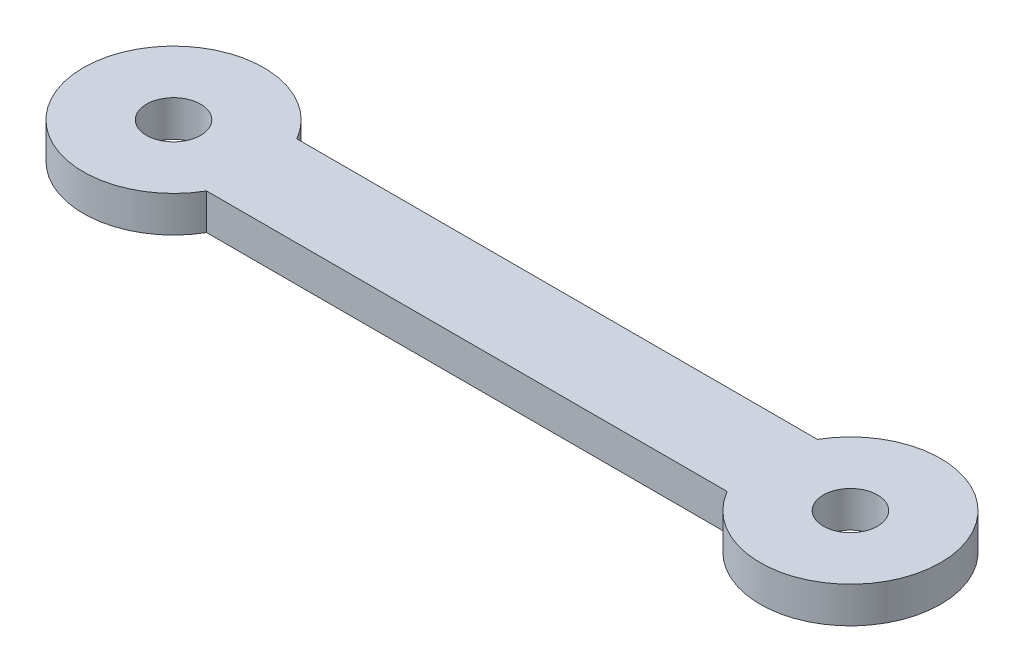
ISO-10303-21;
HEADER;
FILE_DESCRIPTION(('STEP AP214'),'2;1');
FILE_NAME('part.step','',(''),(''),'','','');
FILE_SCHEMA(('AUTOMOTIVE_DESIGN { 1 0 10303 214 1 1 1 1 }'));
ENDSEC;
DATA;
#1=APPLICATION_CONTEXT('core data for automotive mechanical design processes');
#2=APPLICATION_PROTOCOL_DEFINITION('international standard','automotive_design',2000,#1);
#3=PRODUCT_CONTEXT('',#1,'mechanical');
#4=PRODUCT('Part','Part','',(#3));
#5=PRODUCT_RELATED_PRODUCT_CATEGORY('part','',(#4));
#6=PRODUCT_DEFINITION_FORMATION('','',#4);
#7=PRODUCT_DEFINITION_CONTEXT('part definition',#1,'design');
#8=PRODUCT_DEFINITION('design','',#6,#7);
#9=PRODUCT_DEFINITION_SHAPE('','',#8);
#10=(LENGTH_UNIT() NAMED_UNIT(*) SI_UNIT(.MILLI.,.METRE.));
#11=(NAMED_UNIT(*) PLANE_ANGLE_UNIT() SI_UNIT($,.RADIAN.));
#12=(NAMED_UNIT(*) SI_UNIT($,.STERADIAN.) SOLID_ANGLE_UNIT());
#13=UNCERTAINTY_MEASURE_WITH_UNIT(LENGTH_MEASURE(1.E-05),#10,'distance_accuracy_value','');
#14=(GEOMETRIC_REPRESENTATION_CONTEXT(3) GLOBAL_UNCERTAINTY_ASSIGNED_CONTEXT((#13)) GLOBAL_UNIT_ASSIGNED_CONTEXT((#10,
#11,#12)) REPRESENTATION_CONTEXT('',''));
#15=CARTESIAN_POINT('',(0.,0.,0.));
#16=DIRECTION('',(0.,0.,1.));
#17=DIRECTION('',(1.,0.,0.));
#18=AXIS2_PLACEMENT_3D('',#15,#16,#17);
#19=CARTESIAN_POINT('',(75.,2.,0.));
#20=DIRECTION('',(0.,1.,0.));
#21=DIRECTION('',(0.,0.,1.));
#22=AXIS2_PLACEMENT_3D('',#19,#20,#21);
#23=PLANE('',#22);
#24=CARTESIAN_POINT('',(0.,2.,0.));
#25=DIRECTION('',(0.,1.,0.));
#26=DIRECTION('',(0.,0.,1.));
#27=AXIS2_PLACEMENT_3D('',#24,#25,#26);
#28=CIRCLE('',#27,10.);
#29=CARTESIAN_POINT('',(8.66025403784439,2.,5.));
#30=VERTEX_POINT('',#29);
#31=CARTESIAN_POINT('',(8.66025403784439,2.,-5.));
#32=VERTEX_POINT('',#31);
#33=EDGE_CURVE('E88',#30,#32,#28,.F.);
#34=ORIENTED_EDGE('',*,*,#33,.F.);
#35=DIRECTION('',(-1.,0.,0.));
#36=VECTOR('',#35,1.);
#37=CARTESIAN_POINT('',(37.5,2.,5.));
#38=LINE('',#37,#36);
#39=CARTESIAN_POINT('',(66.3397459621556,2.,5.));
#40=VERTEX_POINT('',#39);
#41=EDGE_CURVE('E76',#30,#40,#38,.F.);
#42=ORIENTED_EDGE('',*,*,#41,.T.);
#43=CARTESIAN_POINT('',(75.,2.,0.));
#44=DIRECTION('',(0.,1.,0.));
#45=DIRECTION('',(0.,0.,1.));
#46=AXIS2_PLACEMENT_3D('',#43,#44,#45);
#47=CIRCLE('',#46,10.);
#48=CARTESIAN_POINT('',(66.3397459621556,2.,-5.));
#49=VERTEX_POINT('',#48);
#50=EDGE_CURVE('E35',#49,#40,#47,.F.);
#51=ORIENTED_EDGE('',*,*,#50,.F.);
#52=DIRECTION('',(1.,0.,0.));
#53=VECTOR('',#52,1.);
#54=CARTESIAN_POINT('',(37.5,2.,-5.));
#55=LINE('',#54,#53);
#56=EDGE_CURVE('E75',#49,#32,#55,.F.);
#57=ORIENTED_EDGE('',*,*,#56,.T.);
#58=EDGE_LOOP('',(#34,#42,#51,#57));
#59=FACE_BOUND('',#58,.T.);
#60=CARTESIAN_POINT('',(0.,2.,0.));
#61=DIRECTION('',(0.,1.,0.));
#62=DIRECTION('',(0.,0.,1.));
#63=AXIS2_PLACEMENT_3D('',#60,#61,#62);
#64=CIRCLE('',#63,3.);
#65=CARTESIAN_POINT('',(0.,2.,3.));
#66=VERTEX_POINT('',#65);
#67=EDGE_CURVE('E121',#66,#66,#64,.T.);
#68=ORIENTED_EDGE('',*,*,#67,.F.);
#69=EDGE_LOOP('',(#68));
#70=FACE_BOUND('',#69,.T.);
#71=CARTESIAN_POINT('',(75.,2.,0.));
#72=DIRECTION('',(0.,1.,0.));
#73=DIRECTION('',(0.,0.,1.));
#74=AXIS2_PLACEMENT_3D('',#71,#72,#73);
#75=CIRCLE('',#74,3.00000000000001);
#76=CARTESIAN_POINT('',(75.,2.,3.00000000000001));
#77=VERTEX_POINT('',#76);
#78=EDGE_CURVE('E122',#77,#77,#75,.T.);
#79=ORIENTED_EDGE('',*,*,#78,.F.);
#80=EDGE_LOOP('',(#79));
#81=FACE_BOUND('',#80,.T.);
#82=ADVANCED_FACE('F32',(#59,#70,#81),#23,.T.);
#83=CARTESIAN_POINT('',(75.,0.,0.));
#84=DIRECTION('',(0.,1.,0.));
#85=DIRECTION('',(0.,0.,1.));
#86=AXIS2_PLACEMENT_3D('',#83,#84,#85);
#87=CYLINDRICAL_SURFACE('',#86,10.);
#88=CARTESIAN_POINT('',(75.,-2.,0.));
#89=DIRECTION('',(0.,1.,0.));
#90=DIRECTION('',(0.,0.,1.));
#91=AXIS2_PLACEMENT_3D('',#88,#89,#90);
#92=CIRCLE('',#91,10.);
#93=CARTESIAN_POINT('',(66.3397459621556,-2.,-5.));
#94=VERTEX_POINT('',#93);
#95=CARTESIAN_POINT('',(66.3397459621556,-2.,5.));
#96=VERTEX_POINT('',#95);
#97=EDGE_CURVE('E84',#94,#96,#92,.F.);
#98=ORIENTED_EDGE('',*,*,#97,.F.);
#99=DIRECTION('',(0.,1.,0.));
#100=VECTOR('',#99,1.);
#101=CARTESIAN_POINT('',(66.3397459621556,0.,-5.));
#102=LINE('',#101,#100);
#103=EDGE_CURVE('E81',#94,#49,#102,.T.);
#104=ORIENTED_EDGE('',*,*,#103,.T.);
#105=ORIENTED_EDGE('',*,*,#50,.T.);
#106=DIRECTION('',(0.,1.,0.));
#107=VECTOR('',#106,1.);
#108=CARTESIAN_POINT('',(66.3397459621556,0.,5.));
#109=LINE('',#108,#107);
#110=EDGE_CURVE('E94',#40,#96,#109,.F.);
#111=ORIENTED_EDGE('',*,*,#110,.T.);
#112=EDGE_LOOP('',(#98,#104,#105,#111));
#113=FACE_BOUND('',#112,.T.);
#114=ADVANCED_FACE('F82',(#113),#87,.T.);
#115=CARTESIAN_POINT('',(37.5,0.,5.));
#116=DIRECTION('',(0.,0.,-1.));
#117=DIRECTION('',(-1.,0.,0.));
#118=AXIS2_PLACEMENT_3D('',#115,#116,#117);
#119=PLANE('',#118);
#120=ORIENTED_EDGE('',*,*,#41,.F.);
#121=DIRECTION('',(0.,1.,0.));
#122=VECTOR('',#121,1.);
#123=CARTESIAN_POINT('',(8.66025403784439,0.,5.));
#124=LINE('',#123,#122);
#125=CARTESIAN_POINT('',(8.66025403784439,-2.,5.));
#126=VERTEX_POINT('',#125);
#127=EDGE_CURVE('E91',#126,#30,#124,.T.);
#128=ORIENTED_EDGE('',*,*,#127,.F.);
#129=DIRECTION('',(1.,0.,0.));
#130=VECTOR('',#129,1.);
#131=CARTESIAN_POINT('',(75.,-2.,5.));
#132=LINE('',#131,#130);
#133=EDGE_CURVE('E99',#96,#126,#132,.F.);
#134=ORIENTED_EDGE('',*,*,#133,.F.);
#135=ORIENTED_EDGE('',*,*,#110,.F.);
#136=EDGE_LOOP('',(#120,#128,#134,#135));
#137=FACE_BOUND('',#136,.T.);
#138=ADVANCED_FACE('F107',(#137),#119,.F.);
#139=CARTESIAN_POINT('',(0.,0.,0.));
#140=DIRECTION('',(0.,1.,0.));
#141=DIRECTION('',(0.,0.,1.));
#142=AXIS2_PLACEMENT_3D('',#139,#140,#141);
#143=CYLINDRICAL_SURFACE('',#142,10.);
#144=ORIENTED_EDGE('',*,*,#33,.T.);
#145=DIRECTION('',(0.,1.,0.));
#146=VECTOR('',#145,1.);
#147=CARTESIAN_POINT('',(8.66025403784439,0.,-5.));
#148=LINE('',#147,#146);
#149=CARTESIAN_POINT('',(8.66025403784439,-2.,-5.));
#150=VERTEX_POINT('',#149);
#151=EDGE_CURVE('E50',#32,#150,#148,.F.);
#152=ORIENTED_EDGE('',*,*,#151,.T.);
#153=CARTESIAN_POINT('',(0.,-2.,0.));
#154=DIRECTION('',(0.,1.,0.));
#155=DIRECTION('',(0.,0.,1.));
#156=AXIS2_PLACEMENT_3D('',#153,#154,#155);
#157=CIRCLE('',#156,10.);
#158=EDGE_CURVE('E41',#126,#150,#157,.F.);
#159=ORIENTED_EDGE('',*,*,#158,.F.);
#160=ORIENTED_EDGE('',*,*,#127,.T.);
#161=EDGE_LOOP('',(#144,#152,#159,#160));
#162=FACE_BOUND('',#161,.T.);
#163=ADVANCED_FACE('F108',(#162),#143,.T.);
#164=CARTESIAN_POINT('',(37.5,0.,-5.));
#165=DIRECTION('',(0.,0.,1.));
#166=DIRECTION('',(1.,0.,0.));
#167=AXIS2_PLACEMENT_3D('',#164,#165,#166);
#168=PLANE('',#167);
#169=DIRECTION('',(1.,0.,0.));
#170=VECTOR('',#169,1.);
#171=CARTESIAN_POINT('',(75.,-2.,-5.));
#172=LINE('',#171,#170);
#173=EDGE_CURVE('E11',#150,#94,#172,.T.);
#174=ORIENTED_EDGE('',*,*,#173,.F.);
#175=ORIENTED_EDGE('',*,*,#151,.F.);
#176=ORIENTED_EDGE('',*,*,#56,.F.);
#177=ORIENTED_EDGE('',*,*,#103,.F.);
#178=EDGE_LOOP('',(#174,#175,#176,#177));
#179=FACE_BOUND('',#178,.T.);
#180=ADVANCED_FACE('F87',(#179),#168,.F.);
#181=CARTESIAN_POINT('',(75.,-2.,0.));
#182=DIRECTION('',(0.,-1.,0.));
#183=DIRECTION('',(0.,0.,-1.));
#184=AXIS2_PLACEMENT_3D('',#181,#182,#183);
#185=PLANE('',#184);
#186=ORIENTED_EDGE('',*,*,#158,.T.);
#187=ORIENTED_EDGE('',*,*,#173,.T.);
#188=ORIENTED_EDGE('',*,*,#97,.T.);
#189=ORIENTED_EDGE('',*,*,#133,.T.);
#190=EDGE_LOOP('',(#186,#187,#188,#189));
#191=FACE_BOUND('',#190,.T.);
#192=CARTESIAN_POINT('',(0.,-2.,0.));
#193=DIRECTION('',(0.,-1.,0.));
#194=DIRECTION('',(0.,0.,-1.));
#195=AXIS2_PLACEMENT_3D('',#192,#193,#194);
#196=CIRCLE('',#195,3.);
#197=CARTESIAN_POINT('',(0.,-2.,-3.));
#198=VERTEX_POINT('',#197);
#199=EDGE_CURVE('E79',#198,#198,#196,.F.);
#200=ORIENTED_EDGE('',*,*,#199,.T.);
#201=EDGE_LOOP('',(#200));
#202=FACE_BOUND('',#201,.T.);
#203=CARTESIAN_POINT('',(75.,-2.,0.));
#204=DIRECTION('',(0.,-1.,0.));
#205=DIRECTION('',(0.,0.,-1.));
#206=AXIS2_PLACEMENT_3D('',#203,#204,#205);
#207=CIRCLE('',#206,3.00000000000001);
#208=CARTESIAN_POINT('',(75.,-2.,-3.00000000000001));
#209=VERTEX_POINT('',#208);
#210=EDGE_CURVE('E119',#209,#209,#207,.F.);
#211=ORIENTED_EDGE('',*,*,#210,.T.);
#212=EDGE_LOOP('',(#211));
#213=FACE_BOUND('',#212,.T.);
#214=ADVANCED_FACE('F109',(#191,#202,#213),#185,.T.);
#215=CARTESIAN_POINT('',(0.,-18.9705627484772,0.));
#216=DIRECTION('',(0.,1.,0.));
#217=DIRECTION('',(0.,0.,1.));
#218=AXIS2_PLACEMENT_3D('',#215,#216,#217);
#219=CYLINDRICAL_SURFACE('',#218,3.);
#220=ORIENTED_EDGE('',*,*,#67,.T.);
#221=EDGE_LOOP('',(#220));
#222=FACE_BOUND('',#221,.T.);
#223=ORIENTED_EDGE('',*,*,#199,.F.);
#224=EDGE_LOOP('',(#223));
#225=FACE_BOUND('',#224,.T.);
#226=ADVANCED_FACE('F112',(#222,#225),#219,.F.);
#227=CARTESIAN_POINT('',(75.,-18.9705627484772,0.));
#228=DIRECTION('',(0.,1.,0.));
#229=DIRECTION('',(0.,0.,1.));
#230=AXIS2_PLACEMENT_3D('',#227,#228,#229);
#231=CYLINDRICAL_SURFACE('',#230,3.00000000000001);
#232=ORIENTED_EDGE('',*,*,#78,.T.);
#233=EDGE_LOOP('',(#232));
#234=FACE_BOUND('',#233,.T.);
#235=ORIENTED_EDGE('',*,*,#210,.F.);
#236=EDGE_LOOP('',(#235));
#237=FACE_BOUND('',#236,.T.);
#238=ADVANCED_FACE('F130',(#234,#237),#231,.F.);
#239=CLOSED_SHELL('',(#82,#114,#138,#163,#180,#214,#226,#238));
#240=MANIFOLD_SOLID_BREP('B2',#239);
#241=ADVANCED_BREP_SHAPE_REPRESENTATION('',(#18,#240),#14);
#242=SHAPE_DEFINITION_REPRESENTATION(#9,#241);
ENDSEC;
END-ISO-10303-21;
